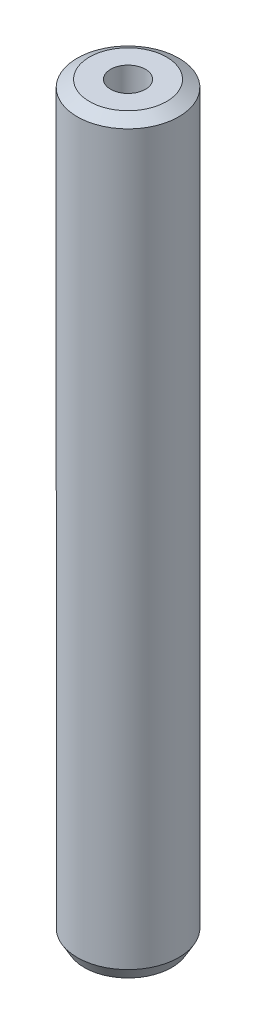
ISO-10303-21;
HEADER;
FILE_DESCRIPTION(('STEP AP214'),'2;1');
FILE_NAME('part.step','',(''),(''),'','','');
FILE_SCHEMA(('AUTOMOTIVE_DESIGN { 1 0 10303 214 1 1 1 1 }'));
ENDSEC;
DATA;
#1=APPLICATION_CONTEXT('core data for automotive mechanical design processes');
#2=APPLICATION_PROTOCOL_DEFINITION('international standard','automotive_design',2000,#1);
#3=PRODUCT_CONTEXT('',#1,'mechanical');
#4=PRODUCT('Part','Part','',(#3));
#5=PRODUCT_RELATED_PRODUCT_CATEGORY('part','',(#4));
#6=PRODUCT_DEFINITION_FORMATION('','',#4);
#7=PRODUCT_DEFINITION_CONTEXT('part definition',#1,'design');
#8=PRODUCT_DEFINITION('design','',#6,#7);
#9=PRODUCT_DEFINITION_SHAPE('','',#8);
#10=(LENGTH_UNIT() NAMED_UNIT(*) SI_UNIT(.MILLI.,.METRE.));
#11=(NAMED_UNIT(*) PLANE_ANGLE_UNIT() SI_UNIT($,.RADIAN.));
#12=(NAMED_UNIT(*) SI_UNIT($,.STERADIAN.) SOLID_ANGLE_UNIT());
#13=UNCERTAINTY_MEASURE_WITH_UNIT(LENGTH_MEASURE(1.E-05),#10,'distance_accuracy_value','');
#14=(GEOMETRIC_REPRESENTATION_CONTEXT(3) GLOBAL_UNCERTAINTY_ASSIGNED_CONTEXT((#13)) GLOBAL_UNIT_ASSIGNED_CONTEXT((#10,
#11,#12)) REPRESENTATION_CONTEXT('',''));
#15=CARTESIAN_POINT('',(0.,0.,0.));
#16=DIRECTION('',(0.,0.,1.));
#17=DIRECTION('',(1.,0.,0.));
#18=AXIS2_PLACEMENT_3D('',#15,#16,#17);
#19=CARTESIAN_POINT('',(0.,331.005184063168,0.));
#20=DIRECTION('',(0.,-1.,0.));
#21=DIRECTION('',(0.,0.,-1.));
#22=AXIS2_PLACEMENT_3D('',#19,#20,#21);
#23=CYLINDRICAL_SURFACE('',#22,22.5);
#24=CARTESIAN_POINT('',(0.,327.872542237132,0.));
#25=DIRECTION('',(0.,1.,0.));
#26=DIRECTION('',(0.,0.,1.));
#27=AXIS2_PLACEMENT_3D('',#24,#25,#26);
#28=CIRCLE('',#27,22.5);
#29=CARTESIAN_POINT('',(0.,327.872542237132,-22.5));
#30=VERTEX_POINT('',#29);
#31=EDGE_CURVE('E50',#30,#30,#28,.F.);
#32=ORIENTED_EDGE('',*,*,#31,.T.);
#33=EDGE_LOOP('',(#32));
#34=FACE_BOUND('',#33,.T.);
#35=CARTESIAN_POINT('',(0.,5.42589480460981,0.));
#36=DIRECTION('',(0.,1.,0.));
#37=DIRECTION('',(0.,0.,1.));
#38=AXIS2_PLACEMENT_3D('',#35,#36,#37);
#39=CIRCLE('',#38,22.5);
#40=CARTESIAN_POINT('',(0.,5.42589480460981,22.5));
#41=VERTEX_POINT('',#40);
#42=EDGE_CURVE('E51',#41,#41,#39,.T.);
#43=ORIENTED_EDGE('',*,*,#42,.T.);
#44=EDGE_LOOP('',(#43));
#45=FACE_BOUND('',#44,.T.);
#46=ADVANCED_FACE('F39',(#34,#45),#23,.T.);
#47=CARTESIAN_POINT('',(0.,331.005184063168,0.));
#48=DIRECTION('',(0.,1.,0.));
#49=DIRECTION('',(0.,0.,1.));
#50=AXIS2_PLACEMENT_3D('',#47,#48,#49);
#51=PLANE('',#50);
#52=CARTESIAN_POINT('',(0.,331.005184063168,0.));
#53=DIRECTION('',(0.,1.,0.));
#54=DIRECTION('',(0.,0.,1.));
#55=AXIS2_PLACEMENT_3D('',#52,#53,#54);
#56=CIRCLE('',#55,17.0741051953903);
#57=CARTESIAN_POINT('',(0.,331.005184063168,-17.0741051953903));
#58=VERTEX_POINT('',#57);
#59=EDGE_CURVE('E54',#58,#58,#56,.T.);
#60=ORIENTED_EDGE('',*,*,#59,.T.);
#61=EDGE_LOOP('',(#60));
#62=FACE_BOUND('',#61,.T.);
#63=CARTESIAN_POINT('',(0.,331.005184063168,0.));
#64=DIRECTION('',(0.,1.,0.));
#65=DIRECTION('',(0.,0.,1.));
#66=AXIS2_PLACEMENT_3D('',#63,#64,#65);
#67=CIRCLE('',#66,7.70251799095274);
#68=CARTESIAN_POINT('',(0.,331.005184063168,7.70251799095274));
#69=VERTEX_POINT('',#68);
#70=EDGE_CURVE('E58',#69,#69,#67,.T.);
#71=ORIENTED_EDGE('',*,*,#70,.F.);
#72=EDGE_LOOP('',(#71));
#73=FACE_BOUND('',#72,.T.);
#74=ADVANCED_FACE('F69',(#62,#73),#51,.T.);
#75=CARTESIAN_POINT('',(0.,0.,0.));
#76=DIRECTION('',(0.,1.,0.));
#77=DIRECTION('',(0.,0.,1.));
#78=AXIS2_PLACEMENT_3D('',#75,#76,#77);
#79=PLANE('',#78);
#80=CARTESIAN_POINT('',(0.,0.,0.));
#81=DIRECTION('',(0.,1.,0.));
#82=DIRECTION('',(0.,0.,1.));
#83=AXIS2_PLACEMENT_3D('',#80,#81,#82);
#84=CIRCLE('',#83,19.3673581739639);
#85=CARTESIAN_POINT('',(0.,0.,19.3673581739639));
#86=VERTEX_POINT('',#85);
#87=EDGE_CURVE('E10',#86,#86,#84,.F.);
#88=ORIENTED_EDGE('',*,*,#87,.T.);
#89=EDGE_LOOP('',(#88));
#90=FACE_BOUND('',#89,.T.);
#91=CARTESIAN_POINT('',(0.,0.,0.));
#92=DIRECTION('',(0.,1.,0.));
#93=DIRECTION('',(0.,0.,1.));
#94=AXIS2_PLACEMENT_3D('',#91,#92,#93);
#95=CIRCLE('',#94,7.70251799095274);
#96=CARTESIAN_POINT('',(0.,0.,7.70251799095274));
#97=VERTEX_POINT('',#96);
#98=EDGE_CURVE('E63',#97,#97,#95,.T.);
#99=ORIENTED_EDGE('',*,*,#98,.T.);
#100=EDGE_LOOP('',(#99));
#101=FACE_BOUND('',#100,.T.);
#102=ADVANCED_FACE('F75',(#90,#101),#79,.F.);
#103=CARTESIAN_POINT('',(0.,331.005184063168,0.));
#104=DIRECTION('',(0.,-1.,0.));
#105=DIRECTION('',(0.,0.,-1.));
#106=AXIS2_PLACEMENT_3D('',#103,#104,#105);
#107=CYLINDRICAL_SURFACE('',#106,7.70251799095274);
#108=ORIENTED_EDGE('',*,*,#70,.T.);
#109=EDGE_LOOP('',(#108));
#110=FACE_BOUND('',#109,.T.);
#111=ORIENTED_EDGE('',*,*,#98,.F.);
#112=EDGE_LOOP('',(#111));
#113=FACE_BOUND('',#112,.T.);
#114=ADVANCED_FACE('F70',(#110,#113),#107,.F.);
#115=CARTESIAN_POINT('',(0.,331.005184063168,0.));
#116=DIRECTION('',(0.,-1.,0.));
#117=DIRECTION('',(0.,0.,-1.));
#118=AXIS2_PLACEMENT_3D('',#115,#116,#117);
#119=CONICAL_SURFACE('',#118,17.0741051953903,1.04719755119659);
#120=CARTESIAN_POINT('',(0.,327.872542237132,-22.5));
#121=CARTESIAN_POINT('',(0.,327.90517392282,-22.443480262452));
#122=CARTESIAN_POINT('',(0.,327.937805608507,-22.386960524904));
#123=CARTESIAN_POINT('',(0.,328.003068979883,-22.273921049808));
#124=CARTESIAN_POINT('',(0.,328.035700665571,-22.21740131226));
#125=CARTESIAN_POINT('',(0.,328.100964036947,-22.1043618371639));
#126=CARTESIAN_POINT('',(0.,328.133595722635,-22.0478420996159));
#127=CARTESIAN_POINT('',(0.,328.19885909401,-21.9348026245199));
#128=CARTESIAN_POINT('',(0.,328.231490779698,-21.8782828869719));
#129=CARTESIAN_POINT('',(0.,328.296754151074,-21.7652434118758));
#130=CARTESIAN_POINT('',(0.,328.329385836762,-21.7087236743278));
#131=CARTESIAN_POINT('',(0.,328.394649208138,-21.5956841992318));
#132=CARTESIAN_POINT('',(0.,328.427280893826,-21.5391644616837));
#133=CARTESIAN_POINT('',(0.,328.492544265201,-21.4261249865877));
#134=CARTESIAN_POINT('',(0.,328.525175950889,-21.3696052490397));
#135=CARTESIAN_POINT('',(0.,328.590439322265,-21.2565657739437));
#136=CARTESIAN_POINT('',(0.,328.623071007953,-21.2000460363956));
#137=CARTESIAN_POINT('',(0.,328.688334379329,-21.0870065612996));
#138=CARTESIAN_POINT('',(0.,328.720966065017,-21.0304868237516));
#139=CARTESIAN_POINT('',(0.,328.786229436392,-20.9174473486555));
#140=CARTESIAN_POINT('',(0.,328.81886112208,-20.8609276111075));
#141=CARTESIAN_POINT('',(0.,328.884124493456,-20.7478881360115));
#142=CARTESIAN_POINT('',(0.,328.916756179144,-20.6913683984635));
#143=CARTESIAN_POINT('',(0.,328.982019550519,-20.5783289233674));
#144=CARTESIAN_POINT('',(0.,329.014651236207,-20.5218091858194));
#145=CARTESIAN_POINT('',(0.,329.079914607583,-20.4087697107234));
#146=CARTESIAN_POINT('',(0.,329.112546293271,-20.3522499731754));
#147=CARTESIAN_POINT('',(0.,329.177809664647,-20.2392104980793));
#148=CARTESIAN_POINT('',(0.,329.210441350335,-20.1826907605313));
#149=CARTESIAN_POINT('',(0.,329.27570472171,-20.0696512854353));
#150=CARTESIAN_POINT('',(0.,329.308336407398,-20.0131315478873));
#151=CARTESIAN_POINT('',(0.,329.373599778774,-19.9000920727912));
#152=CARTESIAN_POINT('',(0.,329.406231464462,-19.8435723352432));
#153=CARTESIAN_POINT('',(0.,329.471494835838,-19.7305328601472));
#154=CARTESIAN_POINT('',(0.,329.504126521526,-19.6740131225992));
#155=CARTESIAN_POINT('',(0.,329.569389892901,-19.5609736475031));
#156=CARTESIAN_POINT('',(0.,329.602021578589,-19.5044539099551));
#157=CARTESIAN_POINT('',(0.,329.667284949965,-19.3914144348591));
#158=CARTESIAN_POINT('',(0.,329.699916635653,-19.334894697311));
#159=CARTESIAN_POINT('',(0.,329.765180007029,-19.221855222215));
#160=CARTESIAN_POINT('',(0.,329.797811692716,-19.165335484667));
#161=CARTESIAN_POINT('',(0.,329.863075064092,-19.0522960095709));
#162=CARTESIAN_POINT('',(0.,329.89570674978,-18.9957762720229));
#163=CARTESIAN_POINT('',(0.,329.960970121156,-18.8827367969269));
#164=CARTESIAN_POINT('',(0.,329.993601806844,-18.8262170593789));
#165=CARTESIAN_POINT('',(0.,330.058865178219,-18.7131775842828));
#166=CARTESIAN_POINT('',(0.,330.091496863907,-18.6566578467348));
#167=CARTESIAN_POINT('',(0.,330.156760235283,-18.5436183716388));
#168=CARTESIAN_POINT('',(0.,330.189391920971,-18.4870986340908));
#169=CARTESIAN_POINT('',(0.,330.254655292347,-18.3740591589947));
#170=CARTESIAN_POINT('',(0.,330.287286978035,-18.3175394214467));
#171=CARTESIAN_POINT('',(0.,330.35255034941,-18.2044999463507));
#172=CARTESIAN_POINT('',(0.,330.385182035098,-18.1479802088027));
#173=CARTESIAN_POINT('',(0.,330.450445406474,-18.0349407337066));
#174=CARTESIAN_POINT('',(0.,330.483077092162,-17.9784209961586));
#175=CARTESIAN_POINT('',(0.,330.548340463538,-17.8653815210626));
#176=CARTESIAN_POINT('',(0.,330.580972149225,-17.8088617835145));
#177=CARTESIAN_POINT('',(0.,330.646235520601,-17.6958223084185));
#178=CARTESIAN_POINT('',(0.,330.678867206289,-17.6393025708705));
#179=CARTESIAN_POINT('',(0.,330.744130577665,-17.5262630957745));
#180=CARTESIAN_POINT('',(0.,330.776762263353,-17.4697433582264));
#181=CARTESIAN_POINT('',(0.,330.842025634728,-17.3567038831304));
#182=CARTESIAN_POINT('',(0.,330.874657320416,-17.3001841455824));
#183=CARTESIAN_POINT('',(0.,330.939920691792,-17.1871446704864));
#184=CARTESIAN_POINT('',(0.,330.97255237748,-17.1306249329383));
#185=CARTESIAN_POINT('',(0.,331.005184063168,-17.0741051953903));
#186=B_SPLINE_CURVE_WITH_KNOTS('',3,(#120,#121,#122,#123,#124,#125,#126,#127,#128,#129,#130,
#131,#132,#133,#134,#135,#136,#137,#138,#139,#140,#141,#142,#143,#144,#145,#146,#147,#148,#149,
#150,#151,#152,#153,#154,#155,#156,#157,#158,#159,#160,#161,#162,#163,#164,#165,#166,#167,#168,
#169,#170,#171,#172,#173,#174,#175,#176,#177,#178,#179,#180,#181,#182,#183,#184,#185),
.UNSPECIFIED.,.F.,.F.,(4,2,2,2,2,2,2,2,2,2,2,2,2,2,2,2,2,2,2,2,2,2,2,2,2,2,2,2,2,2,2,2,4),(0.,
0.195790114127234,0.391580228254496,0.587370342381728,0.78316045650899,0.978950570636252,
1.17474068476349,1.37053079889075,1.56632091301801,1.76211102714524,1.95790114127251,
2.15369125539977,2.349481369527,2.54527148365426,2.74106159778153,2.93685171190876,
3.13264182603602,3.32843194016328,3.52422205429052,3.72001216841778,3.91580228254504,
4.11159239667227,4.30738251079954,4.5031726249268,4.69896273905403,4.89475285318129,
5.09054296730855,5.28633308143579,5.48212319556305,5.67791330969031,5.87370342381754,
6.0694935379448,6.26528365207207),.UNSPECIFIED.);
#187=EDGE_CURVE('BSEAM81',#30,#58,#186,.T.);
#188=ORIENTED_EDGE('',*,*,#31,.F.);
#189=ORIENTED_EDGE('',*,*,#59,.F.);
#190=ORIENTED_EDGE('',*,*,#187,.T.);
#191=ORIENTED_EDGE('',*,*,#187,.F.);
#192=EDGE_LOOP('',(#188,#190,#189,#191));
#193=FACE_BOUND('',#192,.T.);
#194=ADVANCED_FACE('F81',(#193),#119,.T.);
#195=CARTESIAN_POINT('',(0.,5.42589480460981,0.));
#196=DIRECTION('',(0.,1.,0.));
#197=DIRECTION('',(0.,0.,1.));
#198=AXIS2_PLACEMENT_3D('',#195,#196,#197);
#199=CONICAL_SURFACE('',#198,22.5,0.523598775598304);
#200=ORIENTED_EDGE('',*,*,#87,.F.);
#201=EDGE_LOOP('',(#200));
#202=FACE_BOUND('',#201,.T.);
#203=ORIENTED_EDGE('',*,*,#42,.F.);
#204=EDGE_LOOP('',(#203));
#205=FACE_BOUND('',#204,.T.);
#206=ADVANCED_FACE('F45',(#202,#205),#199,.T.);
#207=CLOSED_SHELL('',(#46,#74,#102,#114,#194,#206));
#208=MANIFOLD_SOLID_BREP('B2',#207);
#209=ADVANCED_BREP_SHAPE_REPRESENTATION('',(#18,#208),#14);
#210=SHAPE_DEFINITION_REPRESENTATION(#9,#209);
ENDSEC;
END-ISO-10303-21;
